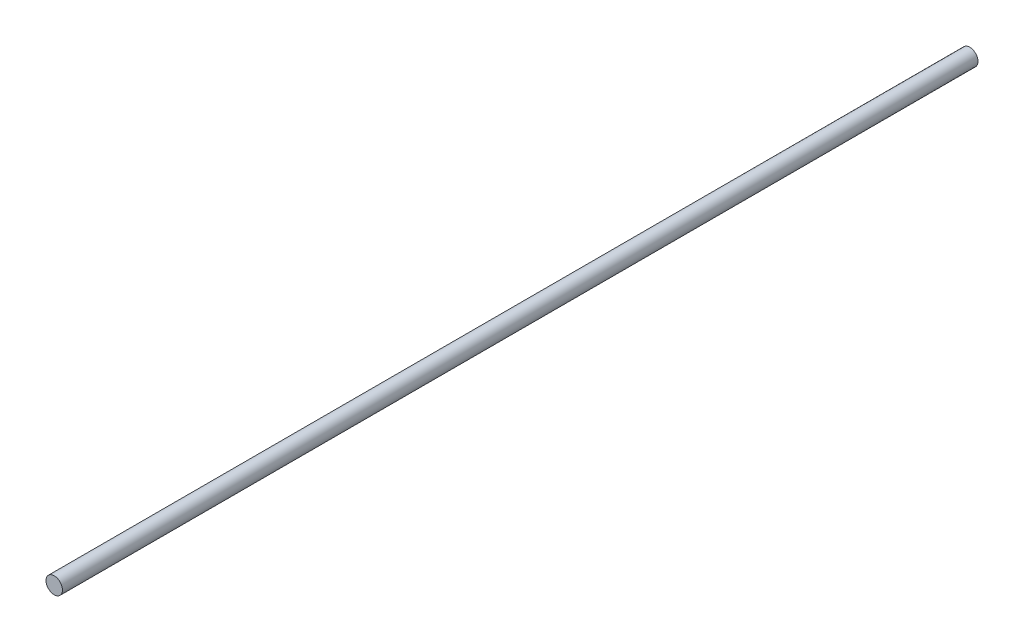
ISO-10303-21;
HEADER;
FILE_DESCRIPTION(('STEP AP214'),'2;1');
FILE_NAME('part.step','',(''),(''),'','','');
FILE_SCHEMA(('AUTOMOTIVE_DESIGN { 1 0 10303 214 1 1 1 1 }'));
ENDSEC;
DATA;
#1=APPLICATION_CONTEXT('core data for automotive mechanical design processes');
#2=APPLICATION_PROTOCOL_DEFINITION('international standard','automotive_design',2000,#1);
#3=PRODUCT_CONTEXT('',#1,'mechanical');
#4=PRODUCT('Part','Part','',(#3));
#5=PRODUCT_RELATED_PRODUCT_CATEGORY('part','',(#4));
#6=PRODUCT_DEFINITION_FORMATION('','',#4);
#7=PRODUCT_DEFINITION_CONTEXT('part definition',#1,'design');
#8=PRODUCT_DEFINITION('design','',#6,#7);
#9=PRODUCT_DEFINITION_SHAPE('','',#8);
#10=(LENGTH_UNIT() NAMED_UNIT(*) SI_UNIT(.MILLI.,.METRE.));
#11=(NAMED_UNIT(*) PLANE_ANGLE_UNIT() SI_UNIT($,.RADIAN.));
#12=(NAMED_UNIT(*) SI_UNIT($,.STERADIAN.) SOLID_ANGLE_UNIT());
#13=UNCERTAINTY_MEASURE_WITH_UNIT(LENGTH_MEASURE(1.E-05),#10,'distance_accuracy_value','');
#14=(GEOMETRIC_REPRESENTATION_CONTEXT(3) GLOBAL_UNCERTAINTY_ASSIGNED_CONTEXT((#13)) GLOBAL_UNIT_ASSIGNED_CONTEXT((#10,
#11,#12)) REPRESENTATION_CONTEXT('',''));
#15=CARTESIAN_POINT('',(0.,0.,0.));
#16=DIRECTION('',(0.,0.,1.));
#17=DIRECTION('',(1.,0.,0.));
#18=AXIS2_PLACEMENT_3D('',#15,#16,#17);
#19=CARTESIAN_POINT('',(0.,0.,50.));
#20=DIRECTION('',(0.,0.,-1.));
#21=DIRECTION('',(-1.,0.,0.));
#22=AXIS2_PLACEMENT_3D('',#19,#20,#21);
#23=CYLINDRICAL_SURFACE('',#22,0.9);
#24=CARTESIAN_POINT('',(0.,0.,50.));
#25=DIRECTION('',(0.,0.,1.));
#26=DIRECTION('',(1.,0.,0.));
#27=AXIS2_PLACEMENT_3D('',#24,#25,#26);
#28=CIRCLE('',#27,0.9);
#29=CARTESIAN_POINT('',(0.9,0.,50.));
#30=VERTEX_POINT('',#29);
#31=EDGE_CURVE('E10',#30,#30,#28,.T.);
#32=ORIENTED_EDGE('',*,*,#31,.F.);
#33=EDGE_LOOP('',(#32));
#34=FACE_BOUND('',#33,.T.);
#35=CARTESIAN_POINT('',(0.,0.,-50.));
#36=DIRECTION('',(0.,0.,1.));
#37=DIRECTION('',(1.,0.,0.));
#38=AXIS2_PLACEMENT_3D('',#35,#36,#37);
#39=CIRCLE('',#38,0.9);
#40=CARTESIAN_POINT('',(0.9,0.,-50.));
#41=VERTEX_POINT('',#40);
#42=EDGE_CURVE('E34',#41,#41,#39,.T.);
#43=ORIENTED_EDGE('',*,*,#42,.T.);
#44=EDGE_LOOP('',(#43));
#45=FACE_BOUND('',#44,.T.);
#46=ADVANCED_FACE('F31',(#34,#45),#23,.T.);
#47=CARTESIAN_POINT('',(0.,0.,50.));
#48=DIRECTION('',(0.,0.,1.));
#49=DIRECTION('',(1.,0.,0.));
#50=AXIS2_PLACEMENT_3D('',#47,#48,#49);
#51=PLANE('',#50);
#52=ORIENTED_EDGE('',*,*,#31,.T.);
#53=EDGE_LOOP('',(#52));
#54=FACE_BOUND('',#53,.T.);
#55=ADVANCED_FACE('F46',(#54),#51,.T.);
#56=CARTESIAN_POINT('',(0.,0.,-50.));
#57=DIRECTION('',(0.,0.,1.));
#58=DIRECTION('',(1.,0.,0.));
#59=AXIS2_PLACEMENT_3D('',#56,#57,#58);
#60=PLANE('',#59);
#61=ORIENTED_EDGE('',*,*,#42,.F.);
#62=EDGE_LOOP('',(#61));
#63=FACE_BOUND('',#62,.T.);
#64=ADVANCED_FACE('F44',(#63),#60,.F.);
#65=CLOSED_SHELL('',(#46,#55,#64));
#66=MANIFOLD_SOLID_BREP('B2',#65);
#67=ADVANCED_BREP_SHAPE_REPRESENTATION('',(#18,#66),#14);
#68=SHAPE_DEFINITION_REPRESENTATION(#9,#67);
ENDSEC;
END-ISO-10303-21;
